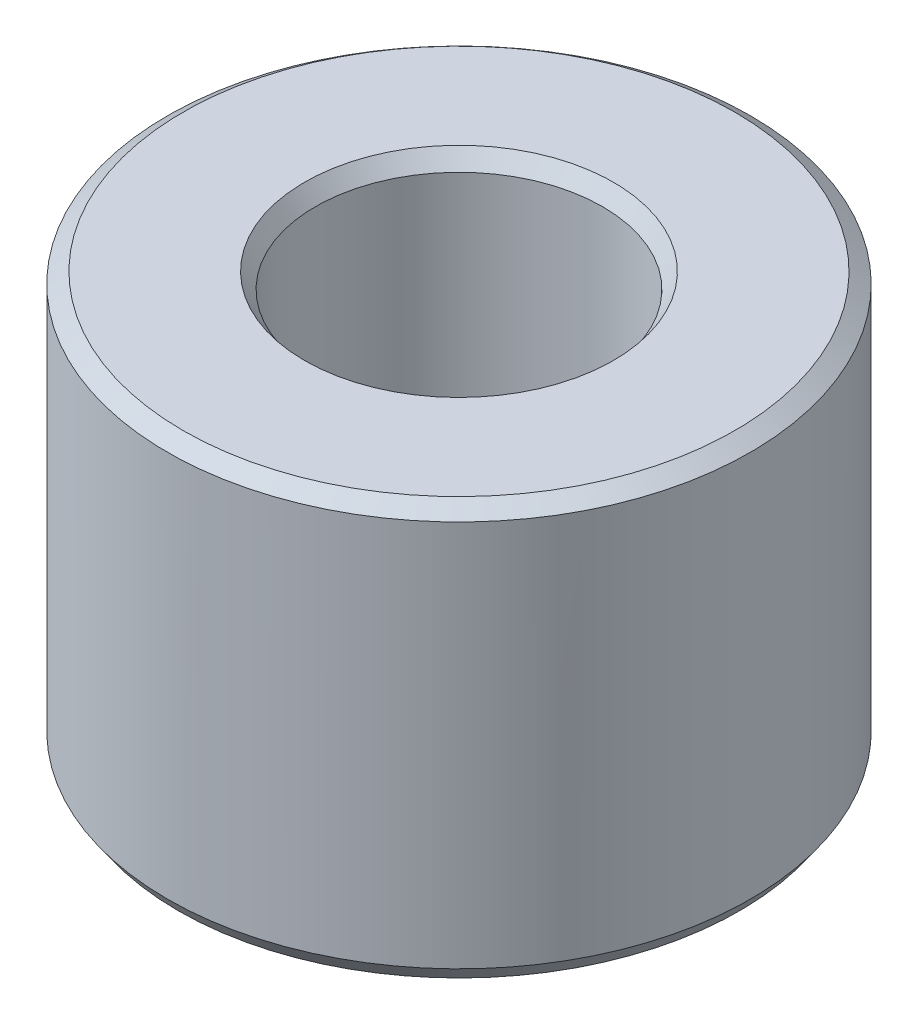
ISO-10303-21;
HEADER;
FILE_DESCRIPTION(('STEP AP214'),'2;1');
FILE_NAME('part.step','',(''),(''),'','','');
FILE_SCHEMA(('AUTOMOTIVE_DESIGN { 1 0 10303 214 1 1 1 1 }'));
ENDSEC;
DATA;
#1=APPLICATION_CONTEXT('core data for automotive mechanical design processes');
#2=APPLICATION_PROTOCOL_DEFINITION('international standard','automotive_design',2000,#1);
#3=PRODUCT_CONTEXT('',#1,'mechanical');
#4=PRODUCT('Part','Part','',(#3));
#5=PRODUCT_RELATED_PRODUCT_CATEGORY('part','',(#4));
#6=PRODUCT_DEFINITION_FORMATION('','',#4);
#7=PRODUCT_DEFINITION_CONTEXT('part definition',#1,'design');
#8=PRODUCT_DEFINITION('design','',#6,#7);
#9=PRODUCT_DEFINITION_SHAPE('','',#8);
#10=(LENGTH_UNIT() NAMED_UNIT(*) SI_UNIT(.MILLI.,.METRE.));
#11=(NAMED_UNIT(*) PLANE_ANGLE_UNIT() SI_UNIT($,.RADIAN.));
#12=(NAMED_UNIT(*) SI_UNIT($,.STERADIAN.) SOLID_ANGLE_UNIT());
#13=UNCERTAINTY_MEASURE_WITH_UNIT(LENGTH_MEASURE(1.E-05),#10,'distance_accuracy_value','');
#14=(GEOMETRIC_REPRESENTATION_CONTEXT(3) GLOBAL_UNCERTAINTY_ASSIGNED_CONTEXT((#13)) GLOBAL_UNIT_ASSIGNED_CONTEXT((#10,
#11,#12)) REPRESENTATION_CONTEXT('',''));
#15=CARTESIAN_POINT('',(0.,0.,0.));
#16=DIRECTION('',(0.,0.,1.));
#17=DIRECTION('',(1.,0.,0.));
#18=AXIS2_PLACEMENT_3D('',#15,#16,#17);
#19=CARTESIAN_POINT('',(0.,53.2060398329869,0.));
#20=DIRECTION('',(0.,-1.,0.));
#21=DIRECTION('',(0.,0.,-1.));
#22=AXIS2_PLACEMENT_3D('',#19,#20,#21);
#23=CYLINDRICAL_SURFACE('',#22,37.5);
#24=CARTESIAN_POINT('',(0.,2.01425572446897,0.));
#25=DIRECTION('',(0.,1.,0.));
#26=DIRECTION('',(0.,0.,1.));
#27=AXIS2_PLACEMENT_3D('',#24,#25,#26);
#28=CIRCLE('',#27,37.5);
#29=CARTESIAN_POINT('',(0.,2.01425572446896,-37.5));
#30=VERTEX_POINT('',#29);
#31=EDGE_CURVE('E10',#30,#30,#28,.T.);
#32=CARTESIAN_POINT('',(0.,51.798604605056,0.));
#33=DIRECTION('',(0.,1.,0.));
#34=DIRECTION('',(0.,0.,1.));
#35=AXIS2_PLACEMENT_3D('',#32,#33,#34);
#36=CIRCLE('',#35,37.5);
#37=CARTESIAN_POINT('',(0.,51.798604605056,-37.5));
#38=VERTEX_POINT('',#37);
#39=EDGE_CURVE('E50',#38,#38,#36,.F.);
#40=CARTESIAN_POINT('',(0.,2.01425572446896,-37.5));
#41=CARTESIAN_POINT('',(0.,2.53284269197508,-37.5));
#42=CARTESIAN_POINT('',(0.,3.0514296594812,-37.5));
#43=CARTESIAN_POINT('',(0.,4.08860359449343,-37.5));
#44=CARTESIAN_POINT('',(0.,4.60719056199954,-37.5));
#45=CARTESIAN_POINT('',(0.,5.64436449701177,-37.5));
#46=CARTESIAN_POINT('',(0.,6.16295146451789,-37.5));
#47=CARTESIAN_POINT('',(0.,7.20012539953012,-37.5));
#48=CARTESIAN_POINT('',(0.,7.71871236703623,-37.5));
#49=CARTESIAN_POINT('',(0.,8.75588630204846,-37.5));
#50=CARTESIAN_POINT('',(0.,9.27447326955458,-37.5));
#51=CARTESIAN_POINT('',(0.,10.3116472045668,-37.5));
#52=CARTESIAN_POINT('',(0.,10.8302341720729,-37.5));
#53=CARTESIAN_POINT('',(0.,11.8674081070852,-37.5));
#54=CARTESIAN_POINT('',(0.,12.3859950745913,-37.5));
#55=CARTESIAN_POINT('',(0.,13.4231690096035,-37.5));
#56=CARTESIAN_POINT('',(0.,13.9417559771096,-37.5));
#57=CARTESIAN_POINT('',(0.,14.9789299121218,-37.5));
#58=CARTESIAN_POINT('',(0.,15.497516879628,-37.5));
#59=CARTESIAN_POINT('',(0.,16.5346908146402,-37.5));
#60=CARTESIAN_POINT('',(0.,17.0532777821463,-37.5));
#61=CARTESIAN_POINT('',(0.,18.0904517171585,-37.5));
#62=CARTESIAN_POINT('',(0.,18.6090386846647,-37.5));
#63=CARTESIAN_POINT('',(0.,19.6462126196769,-37.5));
#64=CARTESIAN_POINT('',(0.,20.164799587183,-37.5));
#65=CARTESIAN_POINT('',(0.,21.2019735221952,-37.5));
#66=CARTESIAN_POINT('',(0.,21.7205604897013,-37.5));
#67=CARTESIAN_POINT('',(0.,22.7577344247136,-37.5));
#68=CARTESIAN_POINT('',(0.,23.2763213922197,-37.5));
#69=CARTESIAN_POINT('',(0.,24.3134953272319,-37.5));
#70=CARTESIAN_POINT('',(0.,24.832082294738,-37.5));
#71=CARTESIAN_POINT('',(0.,25.8692562297503,-37.5));
#72=CARTESIAN_POINT('',(0.,26.3878431972564,-37.5));
#73=CARTESIAN_POINT('',(0.,27.4250171322686,-37.5));
#74=CARTESIAN_POINT('',(0.,27.9436040997747,-37.5));
#75=CARTESIAN_POINT('',(0.,28.980778034787,-37.5));
#76=CARTESIAN_POINT('',(0.,29.4993650022931,-37.5));
#77=CARTESIAN_POINT('',(0.,30.5365389373053,-37.5));
#78=CARTESIAN_POINT('',(0.,31.0551259048114,-37.5));
#79=CARTESIAN_POINT('',(0.,32.0922998398236,-37.5));
#80=CARTESIAN_POINT('',(0.,32.6108868073298,-37.5));
#81=CARTESIAN_POINT('',(0.,33.648060742342,-37.5));
#82=CARTESIAN_POINT('',(0.,34.1666477098481,-37.5));
#83=CARTESIAN_POINT('',(0.,35.2038216448603,-37.5));
#84=CARTESIAN_POINT('',(0.,35.7224086123665,-37.5));
#85=CARTESIAN_POINT('',(0.,36.7595825473787,-37.5));
#86=CARTESIAN_POINT('',(0.,37.2781695148848,-37.5));
#87=CARTESIAN_POINT('',(0.,38.315343449897,-37.5));
#88=CARTESIAN_POINT('',(0.,38.8339304174031,-37.5));
#89=CARTESIAN_POINT('',(0.,39.8711043524154,-37.5));
#90=CARTESIAN_POINT('',(0.,40.3896913199215,-37.5));
#91=CARTESIAN_POINT('',(0.,41.4268652549337,-37.5));
#92=CARTESIAN_POINT('',(0.,41.9454522224398,-37.5));
#93=CARTESIAN_POINT('',(0.,42.9826261574521,-37.5));
#94=CARTESIAN_POINT('',(0.,43.5012131249582,-37.5));
#95=CARTESIAN_POINT('',(0.,44.5383870599704,-37.5));
#96=CARTESIAN_POINT('',(0.,45.0569740274765,-37.5));
#97=CARTESIAN_POINT('',(0.,46.0941479624888,-37.5));
#98=CARTESIAN_POINT('',(0.,46.6127349299949,-37.5));
#99=CARTESIAN_POINT('',(0.,47.6499088650071,-37.5));
#100=CARTESIAN_POINT('',(0.,48.1684958325132,-37.5));
#101=CARTESIAN_POINT('',(0.,49.2056697675254,-37.5));
#102=CARTESIAN_POINT('',(0.,49.7242567350316,-37.5));
#103=CARTESIAN_POINT('',(0.,50.7614306700438,-37.5));
#104=CARTESIAN_POINT('',(0.,51.2800176375499,-37.5));
#105=CARTESIAN_POINT('',(0.,51.798604605056,-37.5));
#106=B_SPLINE_CURVE_WITH_KNOTS('',3,(#40,#41,#42,#43,#44,#45,#46,#47,#48,#49,#50,#51,#52,#53,
#54,#55,#56,#57,#58,#59,#60,#61,#62,#63,#64,#65,#66,#67,#68,#69,#70,#71,#72,#73,#74,#75,#76,#77,
#78,#79,#80,#81,#82,#83,#84,#85,#86,#87,#88,#89,#90,#91,#92,#93,#94,#95,#96,#97,#98,#99,#100,
#101,#102,#103,#104,#105),.UNSPECIFIED.,.F.,.F.,(4,2,2,2,2,2,2,2,2,2,2,2,2,2,2,2,2,2,2,2,2,2,2,
2,2,2,2,2,2,2,2,2,4),(0.,1.55576090251835,3.11152180503669,4.66728270755504,6.22304361007339,
7.77880451259173,9.33456541511007,10.8903263176284,12.4460872201468,14.0018481226651,
15.5576090251835,17.1133699277018,18.6691308302201,20.2248917327385,21.7806526352568,
23.3364135377752,24.8921744402935,26.4479353428119,28.0036962453302,29.5594571478486,
31.1152180503669,32.6709789528853,34.2267398554036,35.782500757922,37.3382616604403,
38.8940225629586,40.449783465477,42.0055443679953,43.5613052705137,45.117066173032,
46.6728270755504,48.2285879780687,49.7843488805871),.UNSPECIFIED.);
#107=EDGE_CURVE('BSEAM39',#30,#38,#106,.T.);
#108=ORIENTED_EDGE('',*,*,#31,.T.);
#109=ORIENTED_EDGE('',*,*,#39,.T.);
#110=ORIENTED_EDGE('',*,*,#107,.T.);
#111=ORIENTED_EDGE('',*,*,#107,.F.);
#112=EDGE_LOOP('',(#108,#110,#109,#111));
#113=FACE_BOUND('',#112,.T.);
#114=ADVANCED_FACE('F39',(#113),#23,.T.);
#115=CARTESIAN_POINT('',(0.,53.2060398329869,0.));
#116=DIRECTION('',(0.,1.,0.));
#117=DIRECTION('',(0.,0.,1.));
#118=AXIS2_PLACEMENT_3D('',#115,#116,#117);
#119=PLANE('',#118);
#120=CARTESIAN_POINT('',(0.,53.2060398329869,0.));
#121=DIRECTION('',(0.,1.,0.));
#122=DIRECTION('',(0.,0.,1.));
#123=AXIS2_PLACEMENT_3D('',#120,#121,#122);
#124=CIRCLE('',#123,19.8710372913325);
#125=CARTESIAN_POINT('',(0.,53.2060398329869,19.8710372913325));
#126=VERTEX_POINT('',#125);
#127=EDGE_CURVE('E58',#126,#126,#124,.F.);
#128=ORIENTED_EDGE('',*,*,#127,.T.);
#129=EDGE_LOOP('',(#128));
#130=FACE_BOUND('',#129,.T.);
#131=CARTESIAN_POINT('',(0.,53.2060398329869,0.));
#132=DIRECTION('',(0.,1.,0.));
#133=DIRECTION('',(0.,0.,1.));
#134=AXIS2_PLACEMENT_3D('',#131,#132,#133);
#135=CIRCLE('',#134,35.4857442755313);
#136=CARTESIAN_POINT('',(0.,53.2060398329869,35.4857442755313));
#137=VERTEX_POINT('',#136);
#138=EDGE_CURVE('E61',#137,#137,#135,.T.);
#139=ORIENTED_EDGE('',*,*,#138,.T.);
#140=EDGE_LOOP('',(#139));
#141=FACE_BOUND('',#140,.T.);
#142=ADVANCED_FACE('F88',(#130,#141),#119,.T.);
#143=CARTESIAN_POINT('',(0.,0.,0.));
#144=DIRECTION('',(0.,1.,0.));
#145=DIRECTION('',(0.,0.,1.));
#146=AXIS2_PLACEMENT_3D('',#143,#144,#145);
#147=PLANE('',#146);
#148=CARTESIAN_POINT('',(0.,0.,0.));
#149=DIRECTION('',(0.,1.,0.));
#150=DIRECTION('',(0.,0.,1.));
#151=AXIS2_PLACEMENT_3D('',#148,#149,#150);
#152=CIRCLE('',#151,20.4778577878703);
#153=CARTESIAN_POINT('',(0.,0.,20.4778577878703));
#154=VERTEX_POINT('',#153);
#155=EDGE_CURVE('E51',#154,#154,#152,.T.);
#156=ORIENTED_EDGE('',*,*,#155,.T.);
#157=EDGE_LOOP('',(#156));
#158=FACE_BOUND('',#157,.T.);
#159=CARTESIAN_POINT('',(0.,0.,0.));
#160=DIRECTION('',(0.,1.,0.));
#161=DIRECTION('',(0.,0.,1.));
#162=AXIS2_PLACEMENT_3D('',#159,#160,#161);
#163=CIRCLE('',#162,36.0925647720689);
#164=CARTESIAN_POINT('',(0.,0.,36.0925647720689));
#165=VERTEX_POINT('',#164);
#166=EDGE_CURVE('E54',#165,#165,#163,.F.);
#167=ORIENTED_EDGE('',*,*,#166,.T.);
#168=EDGE_LOOP('',(#167));
#169=FACE_BOUND('',#168,.T.);
#170=ADVANCED_FACE('F83',(#158,#169),#147,.F.);
#171=CARTESIAN_POINT('',(0.,53.2060398329869,0.));
#172=DIRECTION('',(0.,-1.,0.));
#173=DIRECTION('',(0.,0.,-1.));
#174=AXIS2_PLACEMENT_3D('',#171,#172,#173);
#175=CYLINDRICAL_SURFACE('',#174,18.4636020634015);
#176=CARTESIAN_POINT('',(0.,51.191784108518,0.));
#177=DIRECTION('',(0.,1.,0.));
#178=DIRECTION('',(0.,0.,1.));
#179=AXIS2_PLACEMENT_3D('',#176,#177,#178);
#180=CIRCLE('',#179,18.4636020634015);
#181=CARTESIAN_POINT('',(0.,51.191784108518,-18.4636020634015));
#182=VERTEX_POINT('',#181);
#183=EDGE_CURVE('E67',#182,#182,#180,.T.);
#184=CARTESIAN_POINT('',(0.,1.40743522793096,0.));
#185=DIRECTION('',(0.,1.,0.));
#186=DIRECTION('',(0.,0.,1.));
#187=AXIS2_PLACEMENT_3D('',#184,#185,#186);
#188=CIRCLE('',#187,18.4636020634015);
#189=CARTESIAN_POINT('',(0.,1.40743522793095,-18.4636020634015));
#190=VERTEX_POINT('',#189);
#191=EDGE_CURVE('E69',#190,#190,#188,.F.);
#192=CARTESIAN_POINT('',(0.,51.191784108518,-18.4636020634015));
#193=CARTESIAN_POINT('',(0.,50.6731971410119,-18.4636020634015));
#194=CARTESIAN_POINT('',(0.,50.1546101735058,-18.4636020634015));
#195=CARTESIAN_POINT('',(0.,49.1174362384936,-18.4636020634015));
#196=CARTESIAN_POINT('',(0.,48.5988492709875,-18.4636020634015));
#197=CARTESIAN_POINT('',(0.,47.5616753359752,-18.4636020634015));
#198=CARTESIAN_POINT('',(0.,47.0430883684691,-18.4636020634015));
#199=CARTESIAN_POINT('',(0.,46.0059144334569,-18.4636020634015));
#200=CARTESIAN_POINT('',(0.,45.4873274659508,-18.4636020634015));
#201=CARTESIAN_POINT('',(0.,44.4501535309385,-18.4636020634015));
#202=CARTESIAN_POINT('',(0.,43.9315665634324,-18.4636020634015));
#203=CARTESIAN_POINT('',(0.,42.8943926284202,-18.4636020634015));
#204=CARTESIAN_POINT('',(0.,42.3758056609141,-18.4636020634015));
#205=CARTESIAN_POINT('',(0.,41.3386317259018,-18.4636020634015));
#206=CARTESIAN_POINT('',(0.,40.8200447583957,-18.4636020634015));
#207=CARTESIAN_POINT('',(0.,39.7828708233835,-18.4636020634015));
#208=CARTESIAN_POINT('',(0.,39.2642838558774,-18.4636020634015));
#209=CARTESIAN_POINT('',(0.,38.2271099208652,-18.4636020634015));
#210=CARTESIAN_POINT('',(0.,37.708522953359,-18.4636020634015));
#211=CARTESIAN_POINT('',(0.,36.6713490183468,-18.4636020634015));
#212=CARTESIAN_POINT('',(0.,36.1527620508407,-18.4636020634015));
#213=CARTESIAN_POINT('',(0.,35.1155881158285,-18.4636020634015));
#214=CARTESIAN_POINT('',(0.,34.5970011483223,-18.4636020634015));
#215=CARTESIAN_POINT('',(0.,33.5598272133101,-18.4636020634015));
#216=CARTESIAN_POINT('',(0.,33.041240245804,-18.4636020634015));
#217=CARTESIAN_POINT('',(0.,32.0040663107918,-18.4636020634015));
#218=CARTESIAN_POINT('',(0.,31.4854793432857,-18.4636020634015));
#219=CARTESIAN_POINT('',(0.,30.4483054082734,-18.4636020634015));
#220=CARTESIAN_POINT('',(0.,29.9297184407673,-18.4636020634015));
#221=CARTESIAN_POINT('',(0.,28.8925445057551,-18.4636020634015));
#222=CARTESIAN_POINT('',(0.,28.373957538249,-18.4636020634015));
#223=CARTESIAN_POINT('',(0.,27.3367836032367,-18.4636020634015));
#224=CARTESIAN_POINT('',(0.,26.8181966357306,-18.4636020634015));
#225=CARTESIAN_POINT('',(0.,25.7810227007184,-18.4636020634015));
#226=CARTESIAN_POINT('',(0.,25.2624357332123,-18.4636020634015));
#227=CARTESIAN_POINT('',(0.,24.2252617982,-18.4636020634015));
#228=CARTESIAN_POINT('',(0.,23.7066748306939,-18.4636020634015));
#229=CARTESIAN_POINT('',(0.,22.6695008956817,-18.4636020634015));
#230=CARTESIAN_POINT('',(0.,22.1509139281756,-18.4636020634015));
#231=CARTESIAN_POINT('',(0.,21.1137399931633,-18.4636020634015));
#232=CARTESIAN_POINT('',(0.,20.5951530256572,-18.4636020634015));
#233=CARTESIAN_POINT('',(0.,19.557979090645,-18.4636020634015));
#234=CARTESIAN_POINT('',(0.,19.0393921231389,-18.4636020634015));
#235=CARTESIAN_POINT('',(0.,18.0022181881267,-18.4636020634015));
#236=CARTESIAN_POINT('',(0.,17.4836312206205,-18.4636020634015));
#237=CARTESIAN_POINT('',(0.,16.4464572856083,-18.4636020634015));
#238=CARTESIAN_POINT('',(0.,15.9278703181022,-18.4636020634015));
#239=CARTESIAN_POINT('',(0.,14.89069638309,-18.4636020634015));
#240=CARTESIAN_POINT('',(0.,14.3721094155838,-18.4636020634015));
#241=CARTESIAN_POINT('',(0.,13.3349354805716,-18.4636020634015));
#242=CARTESIAN_POINT('',(0.,12.8163485130655,-18.4636020634015));
#243=CARTESIAN_POINT('',(0.,11.7791745780533,-18.4636020634015));
#244=CARTESIAN_POINT('',(0.,11.2605876105471,-18.4636020634015));
#245=CARTESIAN_POINT('',(0.,10.2234136755349,-18.4636020634015));
#246=CARTESIAN_POINT('',(0.,9.7048267080288,-18.4636020634015));
#247=CARTESIAN_POINT('',(0.,8.66765277301657,-18.4636020634015));
#248=CARTESIAN_POINT('',(0.,8.14906580551045,-18.4636020634015));
#249=CARTESIAN_POINT('',(0.,7.11189187049822,-18.4636020634015));
#250=CARTESIAN_POINT('',(0.,6.5933049029921,-18.4636020634015));
#251=CARTESIAN_POINT('',(0.,5.55613096797987,-18.4636020634015));
#252=CARTESIAN_POINT('',(0.,5.03754400047376,-18.4636020634015));
#253=CARTESIAN_POINT('',(0.,4.00037006546153,-18.4636020634015));
#254=CARTESIAN_POINT('',(0.,3.48178309795541,-18.4636020634015));
#255=CARTESIAN_POINT('',(0.,2.44460916294318,-18.4636020634015));
#256=CARTESIAN_POINT('',(0.,1.92602219543707,-18.4636020634015));
#257=CARTESIAN_POINT('',(0.,1.40743522793095,-18.4636020634015));
#258=B_SPLINE_CURVE_WITH_KNOTS('',3,(#192,#193,#194,#195,#196,#197,#198,#199,#200,#201,#202,
#203,#204,#205,#206,#207,#208,#209,#210,#211,#212,#213,#214,#215,#216,#217,#218,#219,#220,#221,
#222,#223,#224,#225,#226,#227,#228,#229,#230,#231,#232,#233,#234,#235,#236,#237,#238,#239,#240,
#241,#242,#243,#244,#245,#246,#247,#248,#249,#250,#251,#252,#253,#254,#255,#256,#257),
.UNSPECIFIED.,.F.,.F.,(4,2,2,2,2,2,2,2,2,2,2,2,2,2,2,2,2,2,2,2,2,2,2,2,2,2,2,2,2,2,2,2,4),(0.,
1.55576090251834,3.11152180503669,4.66728270755504,6.22304361007339,7.77880451259173,
9.33456541511007,10.8903263176284,12.4460872201468,14.0018481226651,15.5576090251835,
17.1133699277018,18.6691308302202,20.2248917327385,21.7806526352568,23.3364135377752,
24.8921744402935,26.4479353428119,28.0036962453302,29.5594571478486,31.1152180503669,
32.6709789528853,34.2267398554036,35.782500757922,37.3382616604403,38.8940225629587,
40.449783465477,42.0055443679954,43.5613052705137,45.1170661730321,46.6728270755504,
48.2285879780687,49.7843488805871),.UNSPECIFIED.);
#259=EDGE_CURVE('BSEAM71',#182,#190,#258,.T.);
#260=ORIENTED_EDGE('',*,*,#183,.T.);
#261=ORIENTED_EDGE('',*,*,#191,.T.);
#262=ORIENTED_EDGE('',*,*,#259,.T.);
#263=ORIENTED_EDGE('',*,*,#259,.F.);
#264=EDGE_LOOP('',(#260,#262,#261,#263));
#265=FACE_BOUND('',#264,.T.);
#266=ADVANCED_FACE('F71',(#265),#175,.F.);
#267=CARTESIAN_POINT('',(0.,51.191784108518,0.));
#268=DIRECTION('',(0.,1.,0.));
#269=DIRECTION('',(0.,0.,1.));
#270=AXIS2_PLACEMENT_3D('',#267,#268,#269);
#271=CONICAL_SURFACE('',#270,18.4636020634015,0.609877885647817);
#272=ORIENTED_EDGE('',*,*,#127,.F.);
#273=EDGE_LOOP('',(#272));
#274=FACE_BOUND('',#273,.T.);
#275=ORIENTED_EDGE('',*,*,#183,.F.);
#276=EDGE_LOOP('',(#275));
#277=FACE_BOUND('',#276,.T.);
#278=ADVANCED_FACE('F77',(#274,#277),#271,.F.);
#279=CARTESIAN_POINT('',(0.,0.,0.));
#280=DIRECTION('',(0.,-1.,0.));
#281=DIRECTION('',(0.,0.,-1.));
#282=AXIS2_PLACEMENT_3D('',#279,#280,#281);
#283=CONICAL_SURFACE('',#282,20.4778577878703,0.960918441147076);
#284=ORIENTED_EDGE('',*,*,#191,.F.);
#285=EDGE_LOOP('',(#284));
#286=FACE_BOUND('',#285,.T.);
#287=ORIENTED_EDGE('',*,*,#155,.F.);
#288=EDGE_LOOP('',(#287));
#289=FACE_BOUND('',#288,.T.);
#290=ADVANCED_FACE('F73',(#286,#289),#283,.F.);
#291=CARTESIAN_POINT('',(0.,2.01425572446897,0.));
#292=DIRECTION('',(0.,1.,0.));
#293=DIRECTION('',(0.,0.,1.));
#294=AXIS2_PLACEMENT_3D('',#291,#292,#293);
#295=CONICAL_SURFACE('',#294,37.5,0.609877885647816);
#296=ORIENTED_EDGE('',*,*,#166,.F.);
#297=EDGE_LOOP('',(#296));
#298=FACE_BOUND('',#297,.T.);
#299=ORIENTED_EDGE('',*,*,#31,.F.);
#300=EDGE_LOOP('',(#299));
#301=FACE_BOUND('',#300,.T.);
#302=ADVANCED_FACE('F76',(#298,#301),#295,.T.);
#303=CARTESIAN_POINT('',(0.,53.2060398329869,0.));
#304=DIRECTION('',(0.,-1.,0.));
#305=DIRECTION('',(0.,0.,-1.));
#306=AXIS2_PLACEMENT_3D('',#303,#304,#305);
#307=CONICAL_SURFACE('',#306,35.4857442755313,0.960918441147081);
#308=ORIENTED_EDGE('',*,*,#39,.F.);
#309=EDGE_LOOP('',(#308));
#310=FACE_BOUND('',#309,.T.);
#311=ORIENTED_EDGE('',*,*,#138,.F.);
#312=EDGE_LOOP('',(#311));
#313=FACE_BOUND('',#312,.T.);
#314=ADVANCED_FACE('F45',(#310,#313),#307,.T.);
#315=CLOSED_SHELL('',(#114,#142,#170,#266,#278,#290,#302,#314));
#316=MANIFOLD_SOLID_BREP('B2',#315);
#317=ADVANCED_BREP_SHAPE_REPRESENTATION('',(#18,#316),#14);
#318=SHAPE_DEFINITION_REPRESENTATION(#9,#317);
ENDSEC;
END-ISO-10303-21;
